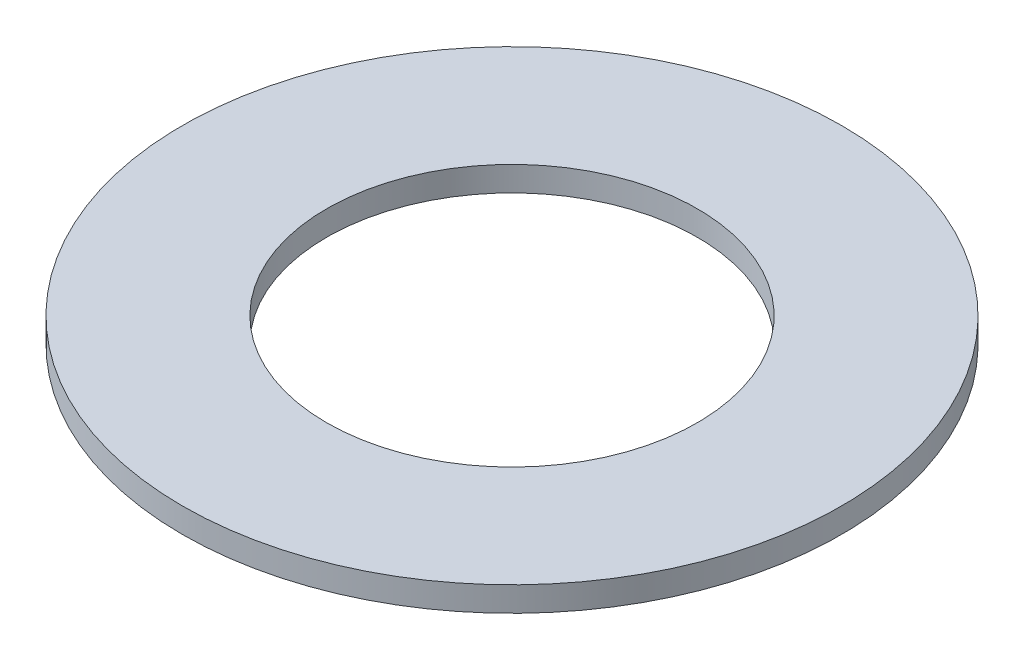
ISO-10303-21;
HEADER;
FILE_DESCRIPTION(('STEP AP214'),'2;1');
FILE_NAME('part.step','',(''),(''),'','','');
FILE_SCHEMA(('AUTOMOTIVE_DESIGN { 1 0 10303 214 1 1 1 1 }'));
ENDSEC;
DATA;
#1=APPLICATION_CONTEXT('core data for automotive mechanical design processes');
#2=APPLICATION_PROTOCOL_DEFINITION('international standard','automotive_design',2000,#1);
#3=PRODUCT_CONTEXT('',#1,'mechanical');
#4=PRODUCT('Part','Part','',(#3));
#5=PRODUCT_RELATED_PRODUCT_CATEGORY('part','',(#4));
#6=PRODUCT_DEFINITION_FORMATION('','',#4);
#7=PRODUCT_DEFINITION_CONTEXT('part definition',#1,'design');
#8=PRODUCT_DEFINITION('design','',#6,#7);
#9=PRODUCT_DEFINITION_SHAPE('','',#8);
#10=(LENGTH_UNIT() NAMED_UNIT(*) SI_UNIT(.MILLI.,.METRE.));
#11=(NAMED_UNIT(*) PLANE_ANGLE_UNIT() SI_UNIT($,.RADIAN.));
#12=(NAMED_UNIT(*) SI_UNIT($,.STERADIAN.) SOLID_ANGLE_UNIT());
#13=UNCERTAINTY_MEASURE_WITH_UNIT(LENGTH_MEASURE(1.E-05),#10,'distance_accuracy_value','');
#14=(GEOMETRIC_REPRESENTATION_CONTEXT(3) GLOBAL_UNCERTAINTY_ASSIGNED_CONTEXT((#13)) GLOBAL_UNIT_ASSIGNED_CONTEXT((#10,
#11,#12)) REPRESENTATION_CONTEXT('',''));
#15=CARTESIAN_POINT('',(0.,0.,0.));
#16=DIRECTION('',(0.,0.,1.));
#17=DIRECTION('',(1.,0.,0.));
#18=AXIS2_PLACEMENT_3D('',#15,#16,#17);
#19=CARTESIAN_POINT('',(0.,6.,0.));
#20=DIRECTION('',(0.,-1.,0.));
#21=DIRECTION('',(0.,0.,-1.));
#22=AXIS2_PLACEMENT_3D('',#19,#20,#21);
#23=CYLINDRICAL_SURFACE('',#22,80.);
#24=CARTESIAN_POINT('',(0.,6.,0.));
#25=DIRECTION('',(0.,1.,0.));
#26=DIRECTION('',(0.,0.,1.));
#27=AXIS2_PLACEMENT_3D('',#24,#25,#26);
#28=CIRCLE('',#27,80.);
#29=CARTESIAN_POINT('',(0.,6.,80.));
#30=VERTEX_POINT('',#29);
#31=EDGE_CURVE('E10',#30,#30,#28,.T.);
#32=ORIENTED_EDGE('',*,*,#31,.F.);
#33=EDGE_LOOP('',(#32));
#34=FACE_BOUND('',#33,.T.);
#35=CARTESIAN_POINT('',(0.,0.,0.));
#36=DIRECTION('',(0.,1.,0.));
#37=DIRECTION('',(0.,0.,1.));
#38=AXIS2_PLACEMENT_3D('',#35,#36,#37);
#39=CIRCLE('',#38,80.);
#40=CARTESIAN_POINT('',(0.,0.,80.));
#41=VERTEX_POINT('',#40);
#42=EDGE_CURVE('E37',#41,#41,#39,.T.);
#43=ORIENTED_EDGE('',*,*,#42,.T.);
#44=EDGE_LOOP('',(#43));
#45=FACE_BOUND('',#44,.T.);
#46=ADVANCED_FACE('F40',(#34,#45),#23,.T.);
#47=CARTESIAN_POINT('',(0.,6.,0.));
#48=DIRECTION('',(0.,1.,0.));
#49=DIRECTION('',(0.,0.,1.));
#50=AXIS2_PLACEMENT_3D('',#47,#48,#49);
#51=PLANE('',#50);
#52=CARTESIAN_POINT('',(0.,6.,0.));
#53=DIRECTION('',(0.,1.,0.));
#54=DIRECTION('',(0.,0.,1.));
#55=AXIS2_PLACEMENT_3D('',#52,#53,#54);
#56=CIRCLE('',#55,45.);
#57=CARTESIAN_POINT('',(0.,6.,45.));
#58=VERTEX_POINT('',#57);
#59=EDGE_CURVE('E50',#58,#58,#56,.T.);
#60=ORIENTED_EDGE('',*,*,#59,.F.);
#61=EDGE_LOOP('',(#60));
#62=FACE_BOUND('',#61,.T.);
#63=ORIENTED_EDGE('',*,*,#31,.T.);
#64=EDGE_LOOP('',(#63));
#65=FACE_BOUND('',#64,.T.);
#66=ADVANCED_FACE('F59',(#62,#65),#51,.T.);
#67=CARTESIAN_POINT('',(0.,0.,0.));
#68=DIRECTION('',(0.,1.,0.));
#69=DIRECTION('',(0.,0.,1.));
#70=AXIS2_PLACEMENT_3D('',#67,#68,#69);
#71=PLANE('',#70);
#72=CARTESIAN_POINT('',(0.,0.,0.));
#73=DIRECTION('',(0.,1.,0.));
#74=DIRECTION('',(0.,0.,1.));
#75=AXIS2_PLACEMENT_3D('',#72,#73,#74);
#76=CIRCLE('',#75,45.);
#77=CARTESIAN_POINT('',(0.,0.,45.));
#78=VERTEX_POINT('',#77);
#79=EDGE_CURVE('E47',#78,#78,#76,.T.);
#80=ORIENTED_EDGE('',*,*,#79,.T.);
#81=EDGE_LOOP('',(#80));
#82=FACE_BOUND('',#81,.T.);
#83=ORIENTED_EDGE('',*,*,#42,.F.);
#84=EDGE_LOOP('',(#83));
#85=FACE_BOUND('',#84,.T.);
#86=ADVANCED_FACE('F58',(#82,#85),#71,.F.);
#87=CARTESIAN_POINT('',(0.,6.,0.));
#88=DIRECTION('',(0.,-1.,0.));
#89=DIRECTION('',(0.,0.,-1.));
#90=AXIS2_PLACEMENT_3D('',#87,#88,#89);
#91=CYLINDRICAL_SURFACE('',#90,45.);
#92=ORIENTED_EDGE('',*,*,#59,.T.);
#93=EDGE_LOOP('',(#92));
#94=FACE_BOUND('',#93,.T.);
#95=ORIENTED_EDGE('',*,*,#79,.F.);
#96=EDGE_LOOP('',(#95));
#97=FACE_BOUND('',#96,.T.);
#98=ADVANCED_FACE('F54',(#94,#97),#91,.F.);
#99=CLOSED_SHELL('',(#46,#66,#86,#98));
#100=MANIFOLD_SOLID_BREP('B2',#99);
#101=ADVANCED_BREP_SHAPE_REPRESENTATION('',(#18,#100),#14);
#102=SHAPE_DEFINITION_REPRESENTATION(#9,#101);
ENDSEC;
END-ISO-10303-21;
